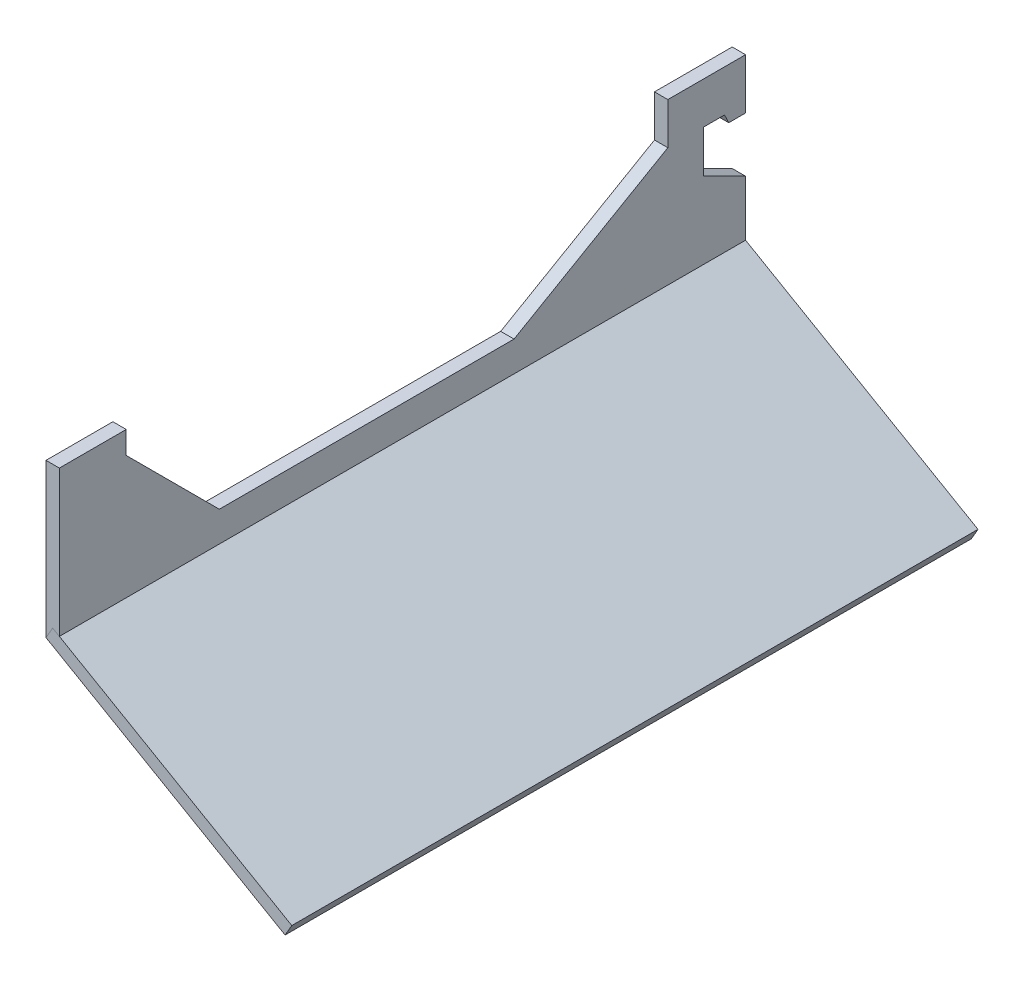
ISO-10303-21;
HEADER;
FILE_DESCRIPTION(('STEP AP214'),'2;1');
FILE_NAME('part.step','',(''),(''),'','','');
FILE_SCHEMA(('AUTOMOTIVE_DESIGN { 1 0 10303 214 1 1 1 1 }'));
ENDSEC;
DATA;
#1=APPLICATION_CONTEXT('core data for automotive mechanical design processes');
#2=APPLICATION_PROTOCOL_DEFINITION('international standard','automotive_design',2000,#1);
#3=PRODUCT_CONTEXT('',#1,'mechanical');
#4=PRODUCT('Part','Part','',(#3));
#5=PRODUCT_RELATED_PRODUCT_CATEGORY('part','',(#4));
#6=PRODUCT_DEFINITION_FORMATION('','',#4);
#7=PRODUCT_DEFINITION_CONTEXT('part definition',#1,'design');
#8=PRODUCT_DEFINITION('design','',#6,#7);
#9=PRODUCT_DEFINITION_SHAPE('','',#8);
#10=(LENGTH_UNIT() NAMED_UNIT(*) SI_UNIT(.MILLI.,.METRE.));
#11=(NAMED_UNIT(*) PLANE_ANGLE_UNIT() SI_UNIT($,.RADIAN.));
#12=(NAMED_UNIT(*) SI_UNIT($,.STERADIAN.) SOLID_ANGLE_UNIT());
#13=UNCERTAINTY_MEASURE_WITH_UNIT(LENGTH_MEASURE(1.E-05),#10,'distance_accuracy_value','');
#14=(GEOMETRIC_REPRESENTATION_CONTEXT(3) GLOBAL_UNCERTAINTY_ASSIGNED_CONTEXT((#13)) GLOBAL_UNIT_ASSIGNED_CONTEXT((#10,
#11,#12)) REPRESENTATION_CONTEXT('',''));
#15=CARTESIAN_POINT('',(0.,0.,0.));
#16=DIRECTION('',(0.,0.,1.));
#17=DIRECTION('',(1.,0.,0.));
#18=AXIS2_PLACEMENT_3D('',#15,#16,#17);
#19=CARTESIAN_POINT('',(1.58750000000001,2.74963065701559,-163.));
#20=DIRECTION('',(0.,0.,-1.));
#21=DIRECTION('',(-1.,0.,0.));
#22=AXIS2_PLACEMENT_3D('',#19,#20,#21);
#23=PLANE('',#22);
#24=DIRECTION('',(0.866025403784436,-0.500000000000004,0.));
#25=VECTOR('',#24,1.);
#26=CARTESIAN_POINT('',(0.,0.,-163.));
#27=LINE('',#26,#25);
#28=CARTESIAN_POINT('',(0.,0.,-163.));
#29=VERTEX_POINT('',#28);
#30=CARTESIAN_POINT('',(56.7946532917996,-32.7904083665523,-163.));
#31=VERTEX_POINT('',#30);
#32=EDGE_CURVE('E107',#29,#31,#27,.T.);
#33=ORIENTED_EDGE('',*,*,#32,.F.);
#34=DIRECTION('',(-0.500000000000004,-0.866025403784436,0.));
#35=VECTOR('',#34,1.);
#36=CARTESIAN_POINT('',(1.58750000000001,2.74963065701559,-163.));
#37=LINE('',#36,#35);
#38=CARTESIAN_POINT('',(1.58750000000001,2.74963065701559,-163.));
#39=VERTEX_POINT('',#38);
#40=EDGE_CURVE('E12',#39,#29,#37,.T.);
#41=ORIENTED_EDGE('',*,*,#40,.F.);
#42=DIRECTION('',(0.866025403784436,-0.500000000000004,0.));
#43=VECTOR('',#42,1.);
#44=CARTESIAN_POINT('',(1.58750000000001,2.74963065701559,-163.));
#45=LINE('',#44,#43);
#46=CARTESIAN_POINT('',(58.3821532917996,-30.0407777095368,-163.));
#47=VERTEX_POINT('',#46);
#48=EDGE_CURVE('E101',#39,#47,#45,.T.);
#49=ORIENTED_EDGE('',*,*,#48,.T.);
#50=DIRECTION('',(-0.500000000000004,-0.866025403784436,0.));
#51=VECTOR('',#50,1.);
#52=CARTESIAN_POINT('',(58.3821532917996,-30.0407777095368,-163.));
#53=LINE('',#52,#51);
#54=EDGE_CURVE('E46',#47,#31,#53,.T.);
#55=ORIENTED_EDGE('',*,*,#54,.T.);
#56=EDGE_LOOP('',(#33,#41,#49,#55));
#57=FACE_BOUND('',#56,.T.);
#58=ADVANCED_FACE('F43',(#57),#23,.T.);
#59=CARTESIAN_POINT('',(1.58750000000001,2.74963065701559,-163.));
#60=DIRECTION('',(-0.866025403784436,0.500000000000004,0.));
#61=DIRECTION('',(-0.500000000000004,-0.866025403784436,0.));
#62=AXIS2_PLACEMENT_3D('',#59,#60,#61);
#63=PLANE('',#62);
#64=DIRECTION('',(0.,0.,-1.));
#65=VECTOR('',#64,1.);
#66=CARTESIAN_POINT('',(0.,0.,-163.));
#67=LINE('',#66,#65);
#68=CARTESIAN_POINT('',(0.,0.,0.));
#69=VERTEX_POINT('',#68);
#70=EDGE_CURVE('E103',#69,#29,#67,.T.);
#71=ORIENTED_EDGE('',*,*,#70,.F.);
#72=DIRECTION('',(-0.500000000000004,-0.866025403784436,0.));
#73=VECTOR('',#72,1.);
#74=CARTESIAN_POINT('',(1.58750000000001,2.74963065701559,0.));
#75=LINE('',#74,#73);
#76=CARTESIAN_POINT('',(1.58750000000001,2.74963065701559,0.));
#77=VERTEX_POINT('',#76);
#78=EDGE_CURVE('E52',#77,#69,#75,.T.);
#79=ORIENTED_EDGE('',*,*,#78,.F.);
#80=DIRECTION('',(0.,0.,-1.));
#81=VECTOR('',#80,1.);
#82=CARTESIAN_POINT('',(1.58750000000001,2.74963065701559,-163.));
#83=LINE('',#82,#81);
#84=EDGE_CURVE('E98',#77,#39,#83,.T.);
#85=ORIENTED_EDGE('',*,*,#84,.T.);
#86=ORIENTED_EDGE('',*,*,#40,.T.);
#87=EDGE_LOOP('',(#71,#79,#85,#86));
#88=FACE_BOUND('',#87,.T.);
#89=ADVANCED_FACE('F117',(#88),#63,.T.);
#90=CARTESIAN_POINT('',(1.58750000000001,2.74963065701559,0.));
#91=DIRECTION('',(0.,0.,1.));
#92=DIRECTION('',(1.,0.,0.));
#93=AXIS2_PLACEMENT_3D('',#90,#91,#92);
#94=PLANE('',#93);
#95=DIRECTION('',(-0.866025403784436,0.500000000000004,0.));
#96=VECTOR('',#95,1.);
#97=CARTESIAN_POINT('',(0.,0.,0.));
#98=LINE('',#97,#96);
#99=CARTESIAN_POINT('',(56.7946532917996,-32.7904083665523,0.));
#100=VERTEX_POINT('',#99);
#101=EDGE_CURVE('E93',#100,#69,#98,.T.);
#102=ORIENTED_EDGE('',*,*,#101,.F.);
#103=DIRECTION('',(-0.500000000000004,-0.866025403784436,0.));
#104=VECTOR('',#103,1.);
#105=CARTESIAN_POINT('',(58.3821532917996,-30.0407777095368,0.));
#106=LINE('',#105,#104);
#107=CARTESIAN_POINT('',(58.3821532917996,-30.0407777095368,0.));
#108=VERTEX_POINT('',#107);
#109=EDGE_CURVE('E88',#108,#100,#106,.T.);
#110=ORIENTED_EDGE('',*,*,#109,.F.);
#111=DIRECTION('',(-0.866025403784436,0.500000000000004,0.));
#112=VECTOR('',#111,1.);
#113=CARTESIAN_POINT('',(1.58750000000001,2.74963065701559,0.));
#114=LINE('',#113,#112);
#115=EDGE_CURVE('E91',#108,#77,#114,.T.);
#116=ORIENTED_EDGE('',*,*,#115,.T.);
#117=ORIENTED_EDGE('',*,*,#78,.T.);
#118=EDGE_LOOP('',(#102,#110,#116,#117));
#119=FACE_BOUND('',#118,.T.);
#120=ADVANCED_FACE('F90',(#119),#94,.T.);
#121=CARTESIAN_POINT('',(58.3821532917996,-30.0407777095368,-163.));
#122=DIRECTION('',(0.866025403784436,-0.500000000000004,0.));
#123=DIRECTION('',(0.500000000000004,0.866025403784436,0.));
#124=AXIS2_PLACEMENT_3D('',#121,#122,#123);
#125=PLANE('',#124);
#126=DIRECTION('',(0.,0.,1.));
#127=VECTOR('',#126,1.);
#128=CARTESIAN_POINT('',(56.7946532917996,-32.7904083665523,-163.));
#129=LINE('',#128,#127);
#130=EDGE_CURVE('E110',#31,#100,#129,.T.);
#131=ORIENTED_EDGE('',*,*,#130,.F.);
#132=ORIENTED_EDGE('',*,*,#54,.F.);
#133=DIRECTION('',(0.,0.,1.));
#134=VECTOR('',#133,1.);
#135=CARTESIAN_POINT('',(58.3821532917996,-30.0407777095368,-163.));
#136=LINE('',#135,#134);
#137=EDGE_CURVE('E97',#47,#108,#136,.T.);
#138=ORIENTED_EDGE('',*,*,#137,.T.);
#139=ORIENTED_EDGE('',*,*,#109,.T.);
#140=EDGE_LOOP('',(#131,#132,#138,#139));
#141=FACE_BOUND('',#140,.T.);
#142=ADVANCED_FACE('F100',(#141),#125,.T.);
#143=CARTESIAN_POINT('',(1.58750000000001,2.74963065701558,0.));
#144=DIRECTION('',(-0.500000000000004,-0.866025403784436,0.));
#145=DIRECTION('',(0.866025403784436,-0.500000000000004,0.));
#146=AXIS2_PLACEMENT_3D('',#143,#144,#145);
#147=PLANE('',#146);
#148=ORIENTED_EDGE('',*,*,#48,.F.);
#149=ORIENTED_EDGE('',*,*,#84,.F.);
#150=ORIENTED_EDGE('',*,*,#115,.F.);
#151=ORIENTED_EDGE('',*,*,#137,.F.);
#152=EDGE_LOOP('',(#148,#149,#150,#151));
#153=FACE_BOUND('',#152,.T.);
#154=ADVANCED_FACE('F96',(#153),#147,.F.);
#155=CARTESIAN_POINT('',(0.,0.,0.));
#156=DIRECTION('',(-0.500000000000004,-0.866025403784436,0.));
#157=DIRECTION('',(0.866025403784436,-0.500000000000004,0.));
#158=AXIS2_PLACEMENT_3D('',#155,#156,#157);
#159=PLANE('',#158);
#160=ORIENTED_EDGE('',*,*,#32,.T.);
#161=ORIENTED_EDGE('',*,*,#130,.T.);
#162=ORIENTED_EDGE('',*,*,#101,.T.);
#163=ORIENTED_EDGE('',*,*,#70,.T.);
#164=EDGE_LOOP('',(#160,#161,#162,#163));
#165=FACE_BOUND('',#164,.T.);
#166=ADVANCED_FACE('F116',(#165),#159,.T.);
#167=CLOSED_SHELL('',(#58,#89,#120,#142,#154,#166));
#168=MANIFOLD_SOLID_BREP('B2',#167);
#169=CARTESIAN_POINT('',(3.175,31.1150816990811,-15.8849183009188));
#170=DIRECTION('',(0.,0.,1.));
#171=DIRECTION('',(0.,-1.,0.));
#172=AXIS2_PLACEMENT_3D('',#169,#170,#171);
#173=PLANE('',#172);
#174=DIRECTION('',(0.,1.,0.));
#175=VECTOR('',#174,1.);
#176=CARTESIAN_POINT('',(0.,31.1150816990811,-15.8849183009188));
#177=LINE('',#176,#175);
#178=CARTESIAN_POINT('',(0.,31.1150816990811,-15.8849183009188));
#179=VERTEX_POINT('',#178);
#180=CARTESIAN_POINT('',(0.,36.4648077538256,-15.8849183009188));
#181=VERTEX_POINT('',#180);
#182=EDGE_CURVE('E311',#179,#181,#177,.T.);
#183=ORIENTED_EDGE('',*,*,#182,.T.);
#184=DIRECTION('',(-1.,0.,0.));
#185=VECTOR('',#184,1.);
#186=CARTESIAN_POINT('',(3.175,36.4648077538256,-15.8849183009188));
#187=LINE('',#186,#185);
#188=CARTESIAN_POINT('',(3.175,36.4648077538256,-15.8849183009188));
#189=VERTEX_POINT('',#188);
#190=EDGE_CURVE('E41',#189,#181,#187,.T.);
#191=ORIENTED_EDGE('',*,*,#190,.F.);
#192=DIRECTION('',(0.,1.,0.));
#193=VECTOR('',#192,1.);
#194=CARTESIAN_POINT('',(3.175,31.1150816990811,-15.8849183009188));
#195=LINE('',#194,#193);
#196=CARTESIAN_POINT('',(3.175,31.1150816990811,-15.8849183009188));
#197=VERTEX_POINT('',#196);
#198=EDGE_CURVE('E343',#197,#189,#195,.T.);
#199=ORIENTED_EDGE('',*,*,#198,.F.);
#200=DIRECTION('',(-1.,0.,0.));
#201=VECTOR('',#200,1.);
#202=CARTESIAN_POINT('',(3.175,31.1150816990811,-15.8849183009188));
#203=LINE('',#202,#201);
#204=EDGE_CURVE('E307',#197,#179,#203,.T.);
#205=ORIENTED_EDGE('',*,*,#204,.T.);
#206=EDGE_LOOP('',(#183,#191,#199,#205));
#207=FACE_BOUND('',#206,.T.);
#208=ADVANCED_FACE('F167',(#207),#173,.F.);
#209=CARTESIAN_POINT('',(3.175,36.4648077538256,-15.8849183009188));
#210=DIRECTION('',(0.,-1.,0.));
#211=DIRECTION('',(0.,0.,-1.));
#212=AXIS2_PLACEMENT_3D('',#209,#210,#211);
#213=PLANE('',#212);
#214=DIRECTION('',(0.,0.,1.));
#215=VECTOR('',#214,1.);
#216=CARTESIAN_POINT('',(0.,36.4648077538256,-15.8849183009188));
#217=LINE('',#216,#215);
#218=CARTESIAN_POINT('',(0.,36.4648077538256,0.));
#219=VERTEX_POINT('',#218);
#220=EDGE_CURVE('E314',#181,#219,#217,.T.);
#221=ORIENTED_EDGE('',*,*,#220,.T.);
#222=DIRECTION('',(-1.,0.,0.));
#223=VECTOR('',#222,1.);
#224=CARTESIAN_POINT('',(3.175,36.4648077538256,0.));
#225=LINE('',#224,#223);
#226=CARTESIAN_POINT('',(3.175,36.4648077538256,0.));
#227=VERTEX_POINT('',#226);
#228=EDGE_CURVE('E175',#227,#219,#225,.T.);
#229=ORIENTED_EDGE('',*,*,#228,.F.);
#230=DIRECTION('',(0.,0.,1.));
#231=VECTOR('',#230,1.);
#232=CARTESIAN_POINT('',(3.175,36.4648077538256,-15.8849183009188));
#233=LINE('',#232,#231);
#234=EDGE_CURVE('E250',#189,#227,#233,.T.);
#235=ORIENTED_EDGE('',*,*,#234,.F.);
#236=ORIENTED_EDGE('',*,*,#190,.T.);
#237=EDGE_LOOP('',(#221,#229,#235,#236));
#238=FACE_BOUND('',#237,.T.);
#239=ADVANCED_FACE('F439',(#238),#213,.F.);
#240=CARTESIAN_POINT('',(3.175,36.4648077538256,0.));
#241=DIRECTION('',(0.,0.,-1.));
#242=DIRECTION('',(0.,1.,0.));
#243=AXIS2_PLACEMENT_3D('',#240,#241,#242);
#244=PLANE('',#243);
#245=DIRECTION('',(0.,-1.,0.));
#246=VECTOR('',#245,1.);
#247=CARTESIAN_POINT('',(0.,36.4648077538256,0.));
#248=LINE('',#247,#246);
#249=CARTESIAN_POINT('',(0.,0.,0.));
#250=VERTEX_POINT('',#249);
#251=EDGE_CURVE('E316',#219,#250,#248,.T.);
#252=ORIENTED_EDGE('',*,*,#251,.T.);
#253=DIRECTION('',(-1.,0.,0.));
#254=VECTOR('',#253,1.);
#255=CARTESIAN_POINT('',(3.175,0.,0.));
#256=LINE('',#255,#254);
#257=CARTESIAN_POINT('',(3.175,0.,0.));
#258=VERTEX_POINT('',#257);
#259=EDGE_CURVE('E374',#258,#250,#256,.T.);
#260=ORIENTED_EDGE('',*,*,#259,.F.);
#261=DIRECTION('',(0.,-1.,0.));
#262=VECTOR('',#261,1.);
#263=CARTESIAN_POINT('',(3.175,36.4648077538256,0.));
#264=LINE('',#263,#262);
#265=EDGE_CURVE('E382',#227,#258,#264,.T.);
#266=ORIENTED_EDGE('',*,*,#265,.F.);
#267=ORIENTED_EDGE('',*,*,#228,.T.);
#268=EDGE_LOOP('',(#252,#260,#266,#267));
#269=FACE_BOUND('',#268,.T.);
#270=ADVANCED_FACE('F380',(#269),#244,.F.);
#271=CARTESIAN_POINT('',(3.175,0.,0.));
#272=DIRECTION('',(0.,1.,0.));
#273=DIRECTION('',(0.,0.,1.));
#274=AXIS2_PLACEMENT_3D('',#271,#272,#273);
#275=PLANE('',#274);
#276=DIRECTION('',(0.,0.,-1.));
#277=VECTOR('',#276,1.);
#278=CARTESIAN_POINT('',(0.,0.,0.));
#279=LINE('',#278,#277);
#280=CARTESIAN_POINT('',(0.,0.,-163.));
#281=VERTEX_POINT('',#280);
#282=EDGE_CURVE('E318',#250,#281,#279,.T.);
#283=ORIENTED_EDGE('',*,*,#282,.T.);
#284=DIRECTION('',(-1.,0.,0.));
#285=VECTOR('',#284,1.);
#286=CARTESIAN_POINT('',(3.175,0.,-163.));
#287=LINE('',#286,#285);
#288=CARTESIAN_POINT('',(3.175,0.,-163.));
#289=VERTEX_POINT('',#288);
#290=EDGE_CURVE('E371',#289,#281,#287,.T.);
#291=ORIENTED_EDGE('',*,*,#290,.F.);
#292=DIRECTION('',(0.,0.,-1.));
#293=VECTOR('',#292,1.);
#294=CARTESIAN_POINT('',(3.175,0.,0.));
#295=LINE('',#294,#293);
#296=EDGE_CURVE('E400',#258,#289,#295,.T.);
#297=ORIENTED_EDGE('',*,*,#296,.F.);
#298=ORIENTED_EDGE('',*,*,#259,.T.);
#299=EDGE_LOOP('',(#283,#291,#297,#298));
#300=FACE_BOUND('',#299,.T.);
#301=ADVANCED_FACE('F391',(#300),#275,.F.);
#302=CARTESIAN_POINT('',(3.175,0.,-163.));
#303=DIRECTION('',(0.,0.,1.));
#304=DIRECTION('',(1.,0.,0.));
#305=AXIS2_PLACEMENT_3D('',#302,#303,#304);
#306=PLANE('',#305);
#307=DIRECTION('',(0.,1.,0.));
#308=VECTOR('',#307,1.);
#309=CARTESIAN_POINT('',(0.,0.,-163.));
#310=LINE('',#309,#308);
#311=CARTESIAN_POINT('',(0.,15.,-163.));
#312=VERTEX_POINT('',#311);
#313=EDGE_CURVE('E320',#281,#312,#310,.T.);
#314=ORIENTED_EDGE('',*,*,#313,.T.);
#315=DIRECTION('',(-1.,0.,0.));
#316=VECTOR('',#315,1.);
#317=CARTESIAN_POINT('',(3.175,15.,-163.));
#318=LINE('',#317,#316);
#319=CARTESIAN_POINT('',(3.175,15.,-163.));
#320=VERTEX_POINT('',#319);
#321=EDGE_CURVE('E368',#320,#312,#318,.T.);
#322=ORIENTED_EDGE('',*,*,#321,.F.);
#323=DIRECTION('',(0.,1.,0.));
#324=VECTOR('',#323,1.);
#325=CARTESIAN_POINT('',(3.175,0.,-163.));
#326=LINE('',#325,#324);
#327=EDGE_CURVE('E397',#289,#320,#326,.T.);
#328=ORIENTED_EDGE('',*,*,#327,.F.);
#329=ORIENTED_EDGE('',*,*,#290,.T.);
#330=EDGE_LOOP('',(#314,#322,#328,#329));
#331=FACE_BOUND('',#330,.T.);
#332=ADVANCED_FACE('F395',(#331),#306,.F.);
#333=CARTESIAN_POINT('',(3.175,20.,-153.));
#334=DIRECTION('',(0.,-0.894427190999916,0.447213595499958));
#335=DIRECTION('',(0.,-0.447213595499958,-0.894427190999916));
#336=AXIS2_PLACEMENT_3D('',#333,#334,#335);
#337=PLANE('',#336);
#338=DIRECTION('',(0.,0.447213595499958,0.894427190999916));
#339=VECTOR('',#338,1.);
#340=CARTESIAN_POINT('',(0.,20.,-153.));
#341=LINE('',#340,#339);
#342=CARTESIAN_POINT('',(0.,20.,-153.));
#343=VERTEX_POINT('',#342);
#344=EDGE_CURVE('E322',#312,#343,#341,.T.);
#345=ORIENTED_EDGE('',*,*,#344,.T.);
#346=DIRECTION('',(-1.,0.,0.));
#347=VECTOR('',#346,1.);
#348=CARTESIAN_POINT('',(3.175,20.,-153.));
#349=LINE('',#348,#347);
#350=CARTESIAN_POINT('',(3.175,20.,-153.));
#351=VERTEX_POINT('',#350);
#352=EDGE_CURVE('E365',#351,#343,#349,.T.);
#353=ORIENTED_EDGE('',*,*,#352,.F.);
#354=DIRECTION('',(0.,0.447213595499958,0.894427190999916));
#355=VECTOR('',#354,1.);
#356=CARTESIAN_POINT('',(3.175,20.,-153.));
#357=LINE('',#356,#355);
#358=EDGE_CURVE('E399',#320,#351,#357,.T.);
#359=ORIENTED_EDGE('',*,*,#358,.F.);
#360=ORIENTED_EDGE('',*,*,#321,.T.);
#361=EDGE_LOOP('',(#345,#353,#359,#360));
#362=FACE_BOUND('',#361,.T.);
#363=ADVANCED_FACE('F452',(#362),#337,.F.);
#364=CARTESIAN_POINT('',(3.175,30.0934449158564,-153.));
#365=DIRECTION('',(0.,0.,1.));
#366=DIRECTION('',(1.,0.,0.));
#367=AXIS2_PLACEMENT_3D('',#364,#365,#366);
#368=PLANE('',#367);
#369=DIRECTION('',(0.,1.,0.));
#370=VECTOR('',#369,1.);
#371=CARTESIAN_POINT('',(0.,30.0934449158564,-153.));
#372=LINE('',#371,#370);
#373=CARTESIAN_POINT('',(0.,30.0934449158564,-153.));
#374=VERTEX_POINT('',#373);
#375=EDGE_CURVE('E324',#343,#374,#372,.T.);
#376=ORIENTED_EDGE('',*,*,#375,.T.);
#377=DIRECTION('',(-1.,0.,0.));
#378=VECTOR('',#377,1.);
#379=CARTESIAN_POINT('',(3.175,30.0934449158564,-153.));
#380=LINE('',#379,#378);
#381=CARTESIAN_POINT('',(3.175,30.0934449158564,-153.));
#382=VERTEX_POINT('',#381);
#383=EDGE_CURVE('E362',#382,#374,#380,.T.);
#384=ORIENTED_EDGE('',*,*,#383,.F.);
#385=DIRECTION('',(0.,1.,0.));
#386=VECTOR('',#385,1.);
#387=CARTESIAN_POINT('',(3.175,30.0934449158564,-153.));
#388=LINE('',#387,#386);
#389=EDGE_CURVE('E402',#351,#382,#388,.T.);
#390=ORIENTED_EDGE('',*,*,#389,.F.);
#391=ORIENTED_EDGE('',*,*,#352,.T.);
#392=EDGE_LOOP('',(#376,#384,#390,#391));
#393=FACE_BOUND('',#392,.T.);
#394=ADVANCED_FACE('F455',(#393),#368,.F.);
#395=CARTESIAN_POINT('',(3.175,30.0934449158564,-158.));
#396=DIRECTION('',(0.,1.,0.));
#397=DIRECTION('',(0.,0.,1.));
#398=AXIS2_PLACEMENT_3D('',#395,#396,#397);
#399=PLANE('',#398);
#400=DIRECTION('',(0.,0.,-1.));
#401=VECTOR('',#400,1.);
#402=CARTESIAN_POINT('',(0.,30.0934449158564,-158.));
#403=LINE('',#402,#401);
#404=CARTESIAN_POINT('',(0.,30.0934449158564,-158.));
#405=VERTEX_POINT('',#404);
#406=EDGE_CURVE('E326',#374,#405,#403,.T.);
#407=ORIENTED_EDGE('',*,*,#406,.T.);
#408=DIRECTION('',(-1.,0.,0.));
#409=VECTOR('',#408,1.);
#410=CARTESIAN_POINT('',(3.175,30.0934449158564,-158.));
#411=LINE('',#410,#409);
#412=CARTESIAN_POINT('',(3.175,30.0934449158564,-158.));
#413=VERTEX_POINT('',#412);
#414=EDGE_CURVE('E359',#413,#405,#411,.T.);
#415=ORIENTED_EDGE('',*,*,#414,.F.);
#416=DIRECTION('',(0.,0.,-1.));
#417=VECTOR('',#416,1.);
#418=CARTESIAN_POINT('',(3.175,30.0934449158564,-158.));
#419=LINE('',#418,#417);
#420=EDGE_CURVE('E408',#382,#413,#419,.T.);
#421=ORIENTED_EDGE('',*,*,#420,.F.);
#422=ORIENTED_EDGE('',*,*,#383,.T.);
#423=EDGE_LOOP('',(#407,#415,#421,#422));
#424=FACE_BOUND('',#423,.T.);
#425=ADVANCED_FACE('F459',(#424),#399,.F.);
#426=CARTESIAN_POINT('',(3.175,28.,-159.));
#427=DIRECTION('',(0.,0.431030013611215,-0.902337590575897));
#428=DIRECTION('',(0.,0.902337590575898,0.431030013611215));
#429=AXIS2_PLACEMENT_3D('',#426,#427,#428);
#430=PLANE('',#429);
#431=DIRECTION('',(0.,-0.902337590575898,-0.431030013611215));
#432=VECTOR('',#431,1.);
#433=CARTESIAN_POINT('',(0.,28.,-159.));
#434=LINE('',#433,#432);
#435=CARTESIAN_POINT('',(0.,28.,-159.));
#436=VERTEX_POINT('',#435);
#437=EDGE_CURVE('E328',#405,#436,#434,.T.);
#438=ORIENTED_EDGE('',*,*,#437,.T.);
#439=DIRECTION('',(-1.,0.,0.));
#440=VECTOR('',#439,1.);
#441=CARTESIAN_POINT('',(3.175,28.,-159.));
#442=LINE('',#441,#440);
#443=CARTESIAN_POINT('',(3.175,28.,-159.));
#444=VERTEX_POINT('',#443);
#445=EDGE_CURVE('E356',#444,#436,#442,.T.);
#446=ORIENTED_EDGE('',*,*,#445,.F.);
#447=DIRECTION('',(0.,-0.902337590575898,-0.431030013611215));
#448=VECTOR('',#447,1.);
#449=CARTESIAN_POINT('',(3.175,28.,-159.));
#450=LINE('',#449,#448);
#451=EDGE_CURVE('E410',#413,#444,#450,.T.);
#452=ORIENTED_EDGE('',*,*,#451,.F.);
#453=ORIENTED_EDGE('',*,*,#414,.T.);
#454=EDGE_LOOP('',(#438,#446,#452,#453));
#455=FACE_BOUND('',#454,.T.);
#456=ADVANCED_FACE('F463',(#455),#430,.F.);
#457=CARTESIAN_POINT('',(3.175,28.,-163.));
#458=DIRECTION('',(0.,1.,0.));
#459=DIRECTION('',(0.,0.,1.));
#460=AXIS2_PLACEMENT_3D('',#457,#458,#459);
#461=PLANE('',#460);
#462=DIRECTION('',(0.,0.,-1.));
#463=VECTOR('',#462,1.);
#464=CARTESIAN_POINT('',(0.,28.,-163.));
#465=LINE('',#464,#463);
#466=CARTESIAN_POINT('',(0.,28.,-163.));
#467=VERTEX_POINT('',#466);
#468=EDGE_CURVE('E330',#436,#467,#465,.T.);
#469=ORIENTED_EDGE('',*,*,#468,.T.);
#470=DIRECTION('',(-1.,0.,0.));
#471=VECTOR('',#470,1.);
#472=CARTESIAN_POINT('',(3.175,28.,-163.));
#473=LINE('',#472,#471);
#474=CARTESIAN_POINT('',(3.175,28.,-163.));
#475=VERTEX_POINT('',#474);
#476=EDGE_CURVE('E353',#475,#467,#473,.T.);
#477=ORIENTED_EDGE('',*,*,#476,.F.);
#478=DIRECTION('',(0.,0.,-1.));
#479=VECTOR('',#478,1.);
#480=CARTESIAN_POINT('',(3.175,28.,-163.));
#481=LINE('',#480,#479);
#482=EDGE_CURVE('E412',#444,#475,#481,.T.);
#483=ORIENTED_EDGE('',*,*,#482,.F.);
#484=ORIENTED_EDGE('',*,*,#445,.T.);
#485=EDGE_LOOP('',(#469,#477,#483,#484));
#486=FACE_BOUND('',#485,.T.);
#487=ADVANCED_FACE('F467',(#486),#461,.F.);
#488=CARTESIAN_POINT('',(3.175,40.,-163.));
#489=DIRECTION('',(0.,0.,1.));
#490=DIRECTION('',(1.,0.,0.));
#491=AXIS2_PLACEMENT_3D('',#488,#489,#490);
#492=PLANE('',#491);
#493=DIRECTION('',(0.,1.,0.));
#494=VECTOR('',#493,1.);
#495=CARTESIAN_POINT('',(0.,40.,-163.));
#496=LINE('',#495,#494);
#497=CARTESIAN_POINT('',(0.,40.,-163.));
#498=VERTEX_POINT('',#497);
#499=EDGE_CURVE('E332',#467,#498,#496,.T.);
#500=ORIENTED_EDGE('',*,*,#499,.T.);
#501=DIRECTION('',(-1.,0.,0.));
#502=VECTOR('',#501,1.);
#503=CARTESIAN_POINT('',(3.175,40.,-163.));
#504=LINE('',#503,#502);
#505=CARTESIAN_POINT('',(3.175,40.,-163.));
#506=VERTEX_POINT('',#505);
#507=EDGE_CURVE('E350',#506,#498,#504,.T.);
#508=ORIENTED_EDGE('',*,*,#507,.F.);
#509=DIRECTION('',(0.,1.,0.));
#510=VECTOR('',#509,1.);
#511=CARTESIAN_POINT('',(3.175,40.,-163.));
#512=LINE('',#511,#510);
#513=EDGE_CURVE('E414',#475,#506,#512,.T.);
#514=ORIENTED_EDGE('',*,*,#513,.F.);
#515=ORIENTED_EDGE('',*,*,#476,.T.);
#516=EDGE_LOOP('',(#500,#508,#514,#515));
#517=FACE_BOUND('',#516,.T.);
#518=ADVANCED_FACE('F471',(#517),#492,.F.);
#519=CARTESIAN_POINT('',(3.175,40.,-144.534918300919));
#520=DIRECTION('',(0.,-1.,0.));
#521=DIRECTION('',(0.,0.,-1.));
#522=AXIS2_PLACEMENT_3D('',#519,#520,#521);
#523=PLANE('',#522);
#524=DIRECTION('',(0.,0.,1.));
#525=VECTOR('',#524,1.);
#526=CARTESIAN_POINT('',(0.,40.,-144.534918300919));
#527=LINE('',#526,#525);
#528=CARTESIAN_POINT('',(0.,40.,-144.534918300919));
#529=VERTEX_POINT('',#528);
#530=EDGE_CURVE('E335',#498,#529,#527,.T.);
#531=ORIENTED_EDGE('',*,*,#530,.T.);
#532=DIRECTION('',(-1.,0.,0.));
#533=VECTOR('',#532,1.);
#534=CARTESIAN_POINT('',(3.175,40.,-144.534918300919));
#535=LINE('',#534,#533);
#536=CARTESIAN_POINT('',(3.175,40.,-144.534918300919));
#537=VERTEX_POINT('',#536);
#538=EDGE_CURVE('E347',#537,#529,#535,.T.);
#539=ORIENTED_EDGE('',*,*,#538,.F.);
#540=DIRECTION('',(0.,0.,1.));
#541=VECTOR('',#540,1.);
#542=CARTESIAN_POINT('',(3.175,40.,-153.));
#543=LINE('',#542,#541);
#544=EDGE_CURVE('E416',#506,#537,#543,.T.);
#545=ORIENTED_EDGE('',*,*,#544,.F.);
#546=ORIENTED_EDGE('',*,*,#507,.T.);
#547=EDGE_LOOP('',(#531,#539,#545,#546));
#548=FACE_BOUND('',#547,.T.);
#549=ADVANCED_FACE('F422',(#548),#523,.F.);
#550=CARTESIAN_POINT('',(3.175,36.4648077538256,-144.534918300919));
#551=DIRECTION('',(0.,0.,-1.));
#552=DIRECTION('',(-1.,0.,0.));
#553=AXIS2_PLACEMENT_3D('',#550,#551,#552);
#554=PLANE('',#553);
#555=DIRECTION('',(0.,-1.,0.));
#556=VECTOR('',#555,1.);
#557=CARTESIAN_POINT('',(0.,36.4648077538256,-144.534918300919));
#558=LINE('',#557,#556);
#559=CARTESIAN_POINT('',(0.,30.0934449158564,-144.534918300919));
#560=VERTEX_POINT('',#559);
#561=EDGE_CURVE('E338',#529,#560,#558,.T.);
#562=ORIENTED_EDGE('',*,*,#561,.T.);
#563=DIRECTION('',(-1.,0.,0.));
#564=VECTOR('',#563,1.);
#565=CARTESIAN_POINT('',(3.175,30.0934449158564,-144.534918300919));
#566=LINE('',#565,#564);
#567=CARTESIAN_POINT('',(3.175,30.0934449158564,-144.534918300919));
#568=VERTEX_POINT('',#567);
#569=EDGE_CURVE('E302',#568,#560,#566,.T.);
#570=ORIENTED_EDGE('',*,*,#569,.F.);
#571=DIRECTION('',(0.,-1.,0.));
#572=VECTOR('',#571,1.);
#573=CARTESIAN_POINT('',(3.175,36.4648077538256,-144.534918300919));
#574=LINE('',#573,#572);
#575=EDGE_CURVE('E293',#537,#568,#574,.T.);
#576=ORIENTED_EDGE('',*,*,#575,.F.);
#577=ORIENTED_EDGE('',*,*,#538,.T.);
#578=EDGE_LOOP('',(#562,#570,#576,#577));
#579=FACE_BOUND('',#578,.T.);
#580=ADVANCED_FACE('F424',(#579),#554,.F.);
#581=CARTESIAN_POINT('',(3.175,30.0934449158564,-144.534918300919));
#582=DIRECTION('',(0.,-0.86602540378444,-0.499999999999998));
#583=DIRECTION('',(0.,0.499999999999998,-0.86602540378444));
#584=AXIS2_PLACEMENT_3D('',#581,#582,#583);
#585=PLANE('',#584);
#586=DIRECTION('',(0.,-0.499999999999998,0.86602540378444));
#587=VECTOR('',#586,1.);
#588=CARTESIAN_POINT('',(0.,30.0934449158564,-144.534918300919));
#589=LINE('',#588,#587);
#590=CARTESIAN_POINT('',(0.,9.,-108.));
#591=VERTEX_POINT('',#590);
#592=EDGE_CURVE('E301',#560,#591,#589,.T.);
#593=ORIENTED_EDGE('',*,*,#592,.T.);
#594=DIRECTION('',(-1.,0.,0.));
#595=VECTOR('',#594,1.);
#596=CARTESIAN_POINT('',(3.175,9.,-108.));
#597=LINE('',#596,#595);
#598=CARTESIAN_POINT('',(3.175,9.,-108.));
#599=VERTEX_POINT('',#598);
#600=EDGE_CURVE('E298',#599,#591,#597,.T.);
#601=ORIENTED_EDGE('',*,*,#600,.F.);
#602=DIRECTION('',(0.,-0.499999999999998,0.86602540378444));
#603=VECTOR('',#602,1.);
#604=CARTESIAN_POINT('',(3.175,30.0934449158564,-144.534918300919));
#605=LINE('',#604,#603);
#606=EDGE_CURVE('E287',#568,#599,#605,.T.);
#607=ORIENTED_EDGE('',*,*,#606,.F.);
#608=ORIENTED_EDGE('',*,*,#569,.T.);
#609=EDGE_LOOP('',(#593,#601,#607,#608));
#610=FACE_BOUND('',#609,.T.);
#611=ADVANCED_FACE('F299',(#610),#585,.F.);
#612=CARTESIAN_POINT('',(3.175,9.,-108.));
#613=DIRECTION('',(0.,-1.,0.));
#614=DIRECTION('',(0.,0.,-1.));
#615=AXIS2_PLACEMENT_3D('',#612,#613,#614);
#616=PLANE('',#615);
#617=DIRECTION('',(0.,0.,1.));
#618=VECTOR('',#617,1.);
#619=CARTESIAN_POINT('',(0.,9.,-108.));
#620=LINE('',#619,#618);
#621=CARTESIAN_POINT('',(0.,8.99999999999999,-38.));
#622=VERTEX_POINT('',#621);
#623=EDGE_CURVE('E236',#591,#622,#620,.T.);
#624=ORIENTED_EDGE('',*,*,#623,.T.);
#625=DIRECTION('',(-1.,0.,0.));
#626=VECTOR('',#625,1.);
#627=CARTESIAN_POINT('',(3.175,8.99999999999999,-38.));
#628=LINE('',#627,#626);
#629=CARTESIAN_POINT('',(3.175,8.99999999999999,-38.));
#630=VERTEX_POINT('',#629);
#631=EDGE_CURVE('E303',#630,#622,#628,.T.);
#632=ORIENTED_EDGE('',*,*,#631,.F.);
#633=DIRECTION('',(0.,0.,1.));
#634=VECTOR('',#633,1.);
#635=CARTESIAN_POINT('',(3.175,9.,-108.));
#636=LINE('',#635,#634);
#637=EDGE_CURVE('E291',#599,#630,#636,.T.);
#638=ORIENTED_EDGE('',*,*,#637,.F.);
#639=ORIENTED_EDGE('',*,*,#600,.T.);
#640=EDGE_LOOP('',(#624,#632,#638,#639));
#641=FACE_BOUND('',#640,.T.);
#642=ADVANCED_FACE('F305',(#641),#616,.F.);
#643=CARTESIAN_POINT('',(3.175,8.99999999999999,-38.));
#644=DIRECTION('',(0.,-0.707106781186549,0.707106781186546));
#645=DIRECTION('',(0.,-0.707106781186546,-0.707106781186549));
#646=AXIS2_PLACEMENT_3D('',#643,#644,#645);
#647=PLANE('',#646);
#648=DIRECTION('',(0.,0.707106781186546,0.707106781186549));
#649=VECTOR('',#648,1.);
#650=CARTESIAN_POINT('',(0.,8.99999999999999,-38.));
#651=LINE('',#650,#649);
#652=EDGE_CURVE('E242',#622,#179,#651,.T.);
#653=ORIENTED_EDGE('',*,*,#652,.T.);
#654=ORIENTED_EDGE('',*,*,#204,.F.);
#655=DIRECTION('',(0.,0.707106781186546,0.707106781186549));
#656=VECTOR('',#655,1.);
#657=CARTESIAN_POINT('',(3.175,8.99999999999999,-38.));
#658=LINE('',#657,#656);
#659=EDGE_CURVE('E183',#630,#197,#658,.T.);
#660=ORIENTED_EDGE('',*,*,#659,.F.);
#661=ORIENTED_EDGE('',*,*,#631,.T.);
#662=EDGE_LOOP('',(#653,#654,#660,#661));
#663=FACE_BOUND('',#662,.T.);
#664=ADVANCED_FACE('F428',(#663),#647,.F.);
#665=CARTESIAN_POINT('',(3.175,0.,0.));
#666=DIRECTION('',(1.,0.,0.));
#667=DIRECTION('',(0.,0.,-1.));
#668=AXIS2_PLACEMENT_3D('',#665,#666,#667);
#669=PLANE('',#668);
#670=ORIENTED_EDGE('',*,*,#198,.T.);
#671=ORIENTED_EDGE('',*,*,#234,.T.);
#672=ORIENTED_EDGE('',*,*,#265,.T.);
#673=ORIENTED_EDGE('',*,*,#296,.T.);
#674=ORIENTED_EDGE('',*,*,#327,.T.);
#675=ORIENTED_EDGE('',*,*,#358,.T.);
#676=ORIENTED_EDGE('',*,*,#389,.T.);
#677=ORIENTED_EDGE('',*,*,#420,.T.);
#678=ORIENTED_EDGE('',*,*,#451,.T.);
#679=ORIENTED_EDGE('',*,*,#482,.T.);
#680=ORIENTED_EDGE('',*,*,#513,.T.);
#681=ORIENTED_EDGE('',*,*,#544,.T.);
#682=ORIENTED_EDGE('',*,*,#575,.T.);
#683=ORIENTED_EDGE('',*,*,#606,.T.);
#684=ORIENTED_EDGE('',*,*,#637,.T.);
#685=ORIENTED_EDGE('',*,*,#659,.T.);
#686=EDGE_LOOP('',(#670,#671,#672,#673,#674,#675,#676,#677,#678,#679,#680,#681,#682,#683,#684,#685));
#687=FACE_BOUND('',#686,.T.);
#688=ADVANCED_FACE('F289',(#687),#669,.T.);
#689=CARTESIAN_POINT('',(0.,0.,0.));
#690=DIRECTION('',(1.,0.,0.));
#691=DIRECTION('',(0.,0.,-1.));
#692=AXIS2_PLACEMENT_3D('',#689,#690,#691);
#693=PLANE('',#692);
#694=ORIENTED_EDGE('',*,*,#182,.F.);
#695=ORIENTED_EDGE('',*,*,#652,.F.);
#696=ORIENTED_EDGE('',*,*,#623,.F.);
#697=ORIENTED_EDGE('',*,*,#592,.F.);
#698=ORIENTED_EDGE('',*,*,#561,.F.);
#699=ORIENTED_EDGE('',*,*,#530,.F.);
#700=ORIENTED_EDGE('',*,*,#499,.F.);
#701=ORIENTED_EDGE('',*,*,#468,.F.);
#702=ORIENTED_EDGE('',*,*,#437,.F.);
#703=ORIENTED_EDGE('',*,*,#406,.F.);
#704=ORIENTED_EDGE('',*,*,#375,.F.);
#705=ORIENTED_EDGE('',*,*,#344,.F.);
#706=ORIENTED_EDGE('',*,*,#313,.F.);
#707=ORIENTED_EDGE('',*,*,#282,.F.);
#708=ORIENTED_EDGE('',*,*,#251,.F.);
#709=ORIENTED_EDGE('',*,*,#220,.F.);
#710=EDGE_LOOP('',(#694,#695,#696,#697,#698,#699,#700,#701,#702,#703,#704,#705,#706,#707,#708,#709));
#711=FACE_BOUND('',#710,.T.);
#712=ADVANCED_FACE('F386',(#711),#693,.F.);
#713=CLOSED_SHELL('',(#208,#239,#270,#301,#332,#363,#394,#425,#456,#487,#518,#549,#580,#611,
#642,#664,#688,#712));
#714=MANIFOLD_SOLID_BREP('B6',#713);
#715=ADVANCED_BREP_SHAPE_REPRESENTATION('',(#18,#168,#714),#14);
#716=SHAPE_DEFINITION_REPRESENTATION(#9,#715);
ENDSEC;
END-ISO-10303-21;
